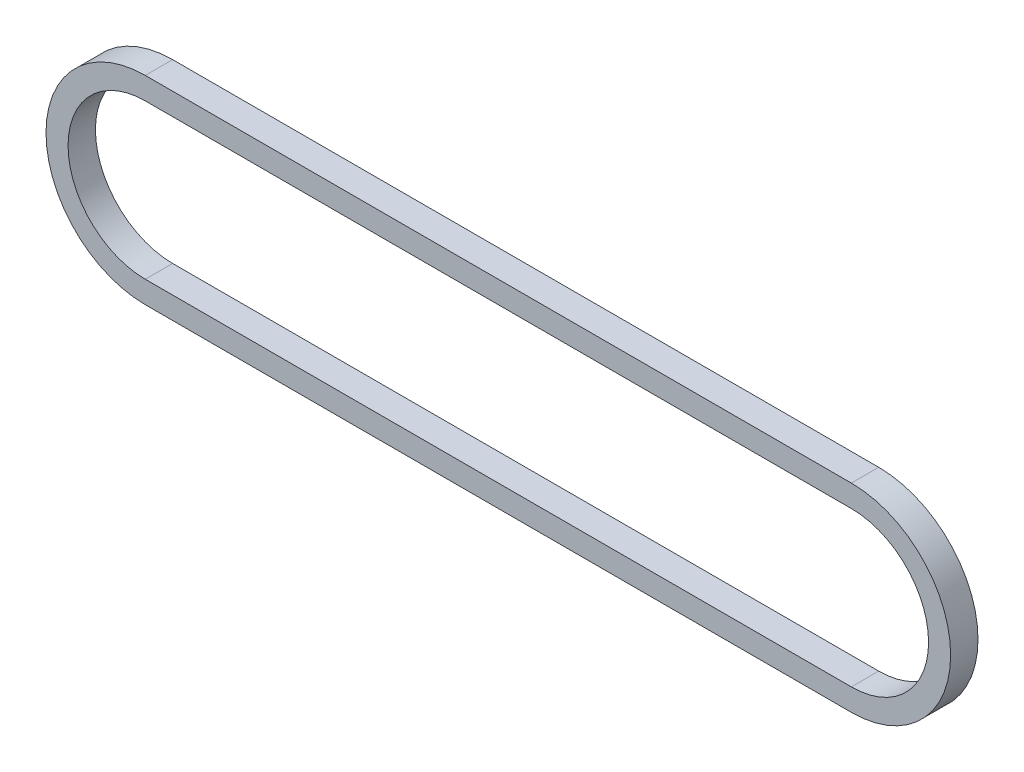
ISO-10303-21;
HEADER;
FILE_DESCRIPTION(('STEP AP214'),'2;1');
FILE_NAME('part.step','',(''),(''),'','','');
FILE_SCHEMA(('AUTOMOTIVE_DESIGN { 1 0 10303 214 1 1 1 1 }'));
ENDSEC;
DATA;
#1=APPLICATION_CONTEXT('core data for automotive mechanical design processes');
#2=APPLICATION_PROTOCOL_DEFINITION('international standard','automotive_design',2000,#1);
#3=PRODUCT_CONTEXT('',#1,'mechanical');
#4=PRODUCT('Part','Part','',(#3));
#5=PRODUCT_RELATED_PRODUCT_CATEGORY('part','',(#4));
#6=PRODUCT_DEFINITION_FORMATION('','',#4);
#7=PRODUCT_DEFINITION_CONTEXT('part definition',#1,'design');
#8=PRODUCT_DEFINITION('design','',#6,#7);
#9=PRODUCT_DEFINITION_SHAPE('','',#8);
#10=(LENGTH_UNIT() NAMED_UNIT(*) SI_UNIT(.MILLI.,.METRE.));
#11=(NAMED_UNIT(*) PLANE_ANGLE_UNIT() SI_UNIT($,.RADIAN.));
#12=(NAMED_UNIT(*) SI_UNIT($,.STERADIAN.) SOLID_ANGLE_UNIT());
#13=UNCERTAINTY_MEASURE_WITH_UNIT(LENGTH_MEASURE(1.E-05),#10,'distance_accuracy_value','');
#14=(GEOMETRIC_REPRESENTATION_CONTEXT(3) GLOBAL_UNCERTAINTY_ASSIGNED_CONTEXT((#13)) GLOBAL_UNIT_ASSIGNED_CONTEXT((#10,
#11,#12)) REPRESENTATION_CONTEXT('',''));
#15=CARTESIAN_POINT('',(0.,0.,0.));
#16=DIRECTION('',(0.,0.,1.));
#17=DIRECTION('',(1.,0.,0.));
#18=AXIS2_PLACEMENT_3D('',#15,#16,#17);
#19=CARTESIAN_POINT('',(0.,0.,7.874));
#20=DIRECTION('',(0.,0.,1.));
#21=DIRECTION('',(1.,0.,0.));
#22=AXIS2_PLACEMENT_3D('',#19,#20,#21);
#23=PLANE('',#22);
#24=CARTESIAN_POINT('',(0.,0.,7.874));
#25=DIRECTION('',(0.,0.,1.));
#26=DIRECTION('',(1.,0.,0.));
#27=AXIS2_PLACEMENT_3D('',#24,#25,#26);
#28=CIRCLE('',#27,28.575);
#29=CARTESIAN_POINT('',(0.,28.575,7.874));
#30=VERTEX_POINT('',#29);
#31=CARTESIAN_POINT('',(0.,-28.575,7.874));
#32=VERTEX_POINT('',#31);
#33=EDGE_CURVE('E159',#30,#32,#28,.T.);
#34=ORIENTED_EDGE('',*,*,#33,.T.);
#35=DIRECTION('',(1.,0.,0.));
#36=VECTOR('',#35,1.);
#37=CARTESIAN_POINT('',(0.,-28.575,7.874));
#38=LINE('',#37,#36);
#39=CARTESIAN_POINT('',(203.2,-28.575,7.874));
#40=VERTEX_POINT('',#39);
#41=EDGE_CURVE('E163',#32,#40,#38,.T.);
#42=ORIENTED_EDGE('',*,*,#41,.T.);
#43=CARTESIAN_POINT('',(203.2,0.,7.874));
#44=DIRECTION('',(0.,0.,1.));
#45=DIRECTION('',(1.,0.,0.));
#46=AXIS2_PLACEMENT_3D('',#43,#44,#45);
#47=CIRCLE('',#46,28.575);
#48=CARTESIAN_POINT('',(203.2,28.575,7.874));
#49=VERTEX_POINT('',#48);
#50=EDGE_CURVE('E167',#40,#49,#47,.T.);
#51=ORIENTED_EDGE('',*,*,#50,.T.);
#52=DIRECTION('',(-1.,0.,0.));
#53=VECTOR('',#52,1.);
#54=CARTESIAN_POINT('',(0.,28.575,7.874));
#55=LINE('',#54,#53);
#56=EDGE_CURVE('E170',#49,#30,#55,.T.);
#57=ORIENTED_EDGE('',*,*,#56,.T.);
#58=EDGE_LOOP('',(#34,#42,#51,#57));
#59=FACE_BOUND('',#58,.T.);
#60=DIRECTION('',(1.,0.,0.));
#61=VECTOR('',#60,1.);
#62=CARTESIAN_POINT('',(0.,-22.225,7.874));
#63=LINE('',#62,#61);
#64=CARTESIAN_POINT('',(0.,-22.225,7.874));
#65=VERTEX_POINT('',#64);
#66=CARTESIAN_POINT('',(203.2,-22.225,7.874));
#67=VERTEX_POINT('',#66);
#68=EDGE_CURVE('E120',#65,#67,#63,.T.);
#69=ORIENTED_EDGE('',*,*,#68,.F.);
#70=CARTESIAN_POINT('',(0.,0.,7.874));
#71=DIRECTION('',(0.,0.,1.));
#72=DIRECTION('',(1.,0.,0.));
#73=AXIS2_PLACEMENT_3D('',#70,#71,#72);
#74=CIRCLE('',#73,22.225);
#75=CARTESIAN_POINT('',(0.,22.225,7.874));
#76=VERTEX_POINT('',#75);
#77=EDGE_CURVE('E111',#76,#65,#74,.T.);
#78=ORIENTED_EDGE('',*,*,#77,.F.);
#79=DIRECTION('',(-1.,0.,0.));
#80=VECTOR('',#79,1.);
#81=CARTESIAN_POINT('',(0.,22.225,7.874));
#82=LINE('',#81,#80);
#83=CARTESIAN_POINT('',(203.2,22.225,7.874));
#84=VERTEX_POINT('',#83);
#85=EDGE_CURVE('E137',#84,#76,#82,.T.);
#86=ORIENTED_EDGE('',*,*,#85,.F.);
#87=CARTESIAN_POINT('',(203.2,0.,7.874));
#88=DIRECTION('',(0.,0.,1.));
#89=DIRECTION('',(1.,0.,0.));
#90=AXIS2_PLACEMENT_3D('',#87,#88,#89);
#91=CIRCLE('',#90,22.225);
#92=EDGE_CURVE('E133',#67,#84,#91,.T.);
#93=ORIENTED_EDGE('',*,*,#92,.F.);
#94=EDGE_LOOP('',(#69,#78,#86,#93));
#95=FACE_BOUND('',#94,.T.);
#96=ADVANCED_FACE('F45',(#59,#95),#23,.T.);
#97=CARTESIAN_POINT('',(0.,0.,0.));
#98=DIRECTION('',(0.,0.,1.));
#99=DIRECTION('',(1.,0.,0.));
#100=AXIS2_PLACEMENT_3D('',#97,#98,#99);
#101=PLANE('',#100);
#102=CARTESIAN_POINT('',(0.,0.,0.));
#103=DIRECTION('',(0.,0.,1.));
#104=DIRECTION('',(1.,0.,0.));
#105=AXIS2_PLACEMENT_3D('',#102,#103,#104);
#106=CIRCLE('',#105,28.575);
#107=CARTESIAN_POINT('',(0.,28.575,0.));
#108=VERTEX_POINT('',#107);
#109=CARTESIAN_POINT('',(0.,-28.575,0.));
#110=VERTEX_POINT('',#109);
#111=EDGE_CURVE('E129',#108,#110,#106,.T.);
#112=ORIENTED_EDGE('',*,*,#111,.F.);
#113=DIRECTION('',(-1.,0.,0.));
#114=VECTOR('',#113,1.);
#115=CARTESIAN_POINT('',(0.,28.575,0.));
#116=LINE('',#115,#114);
#117=CARTESIAN_POINT('',(203.2,28.575,0.));
#118=VERTEX_POINT('',#117);
#119=EDGE_CURVE('E164',#118,#108,#116,.T.);
#120=ORIENTED_EDGE('',*,*,#119,.F.);
#121=CARTESIAN_POINT('',(203.2,0.,0.));
#122=DIRECTION('',(0.,0.,1.));
#123=DIRECTION('',(1.,0.,0.));
#124=AXIS2_PLACEMENT_3D('',#121,#122,#123);
#125=CIRCLE('',#124,28.575);
#126=CARTESIAN_POINT('',(203.2,-28.575,0.));
#127=VERTEX_POINT('',#126);
#128=EDGE_CURVE('E180',#127,#118,#125,.T.);
#129=ORIENTED_EDGE('',*,*,#128,.F.);
#130=DIRECTION('',(1.,0.,0.));
#131=VECTOR('',#130,1.);
#132=CARTESIAN_POINT('',(0.,-28.575,0.));
#133=LINE('',#132,#131);
#134=EDGE_CURVE('E177',#110,#127,#133,.T.);
#135=ORIENTED_EDGE('',*,*,#134,.F.);
#136=EDGE_LOOP('',(#112,#120,#129,#135));
#137=FACE_BOUND('',#136,.T.);
#138=CARTESIAN_POINT('',(0.,0.,0.));
#139=DIRECTION('',(0.,0.,1.));
#140=DIRECTION('',(1.,0.,0.));
#141=AXIS2_PLACEMENT_3D('',#138,#139,#140);
#142=CIRCLE('',#141,22.225);
#143=CARTESIAN_POINT('',(0.,22.225,0.));
#144=VERTEX_POINT('',#143);
#145=CARTESIAN_POINT('',(0.,-22.225,0.));
#146=VERTEX_POINT('',#145);
#147=EDGE_CURVE('E69',#144,#146,#142,.T.);
#148=ORIENTED_EDGE('',*,*,#147,.T.);
#149=DIRECTION('',(1.,0.,0.));
#150=VECTOR('',#149,1.);
#151=CARTESIAN_POINT('',(0.,-22.225,0.));
#152=LINE('',#151,#150);
#153=CARTESIAN_POINT('',(203.2,-22.225,0.));
#154=VERTEX_POINT('',#153);
#155=EDGE_CURVE('E127',#146,#154,#152,.T.);
#156=ORIENTED_EDGE('',*,*,#155,.T.);
#157=CARTESIAN_POINT('',(203.2,0.,0.));
#158=DIRECTION('',(0.,0.,1.));
#159=DIRECTION('',(1.,0.,0.));
#160=AXIS2_PLACEMENT_3D('',#157,#158,#159);
#161=CIRCLE('',#160,22.225);
#162=CARTESIAN_POINT('',(203.2,22.225,0.));
#163=VERTEX_POINT('',#162);
#164=EDGE_CURVE('E146',#154,#163,#161,.T.);
#165=ORIENTED_EDGE('',*,*,#164,.T.);
#166=DIRECTION('',(-1.,0.,0.));
#167=VECTOR('',#166,1.);
#168=CARTESIAN_POINT('',(0.,22.225,0.));
#169=LINE('',#168,#167);
#170=EDGE_CURVE('E121',#163,#144,#169,.T.);
#171=ORIENTED_EDGE('',*,*,#170,.T.);
#172=EDGE_LOOP('',(#148,#156,#165,#171));
#173=FACE_BOUND('',#172,.T.);
#174=ADVANCED_FACE('F203',(#137,#173),#101,.F.);
#175=CARTESIAN_POINT('',(0.,0.,7.874));
#176=DIRECTION('',(0.,0.,-1.));
#177=DIRECTION('',(-1.,0.,0.));
#178=AXIS2_PLACEMENT_3D('',#175,#176,#177);
#179=CYLINDRICAL_SURFACE('',#178,28.575);
#180=ORIENTED_EDGE('',*,*,#111,.T.);
#181=DIRECTION('',(0.,0.,-1.));
#182=VECTOR('',#181,1.);
#183=CARTESIAN_POINT('',(0.,-28.575,7.874));
#184=LINE('',#183,#182);
#185=EDGE_CURVE('E11',#32,#110,#184,.T.);
#186=ORIENTED_EDGE('',*,*,#185,.F.);
#187=ORIENTED_EDGE('',*,*,#33,.F.);
#188=DIRECTION('',(0.,0.,-1.));
#189=VECTOR('',#188,1.);
#190=CARTESIAN_POINT('',(0.,28.575,7.874));
#191=LINE('',#190,#189);
#192=EDGE_CURVE('E173',#30,#108,#191,.T.);
#193=ORIENTED_EDGE('',*,*,#192,.T.);
#194=EDGE_LOOP('',(#180,#186,#187,#193));
#195=FACE_BOUND('',#194,.T.);
#196=ADVANCED_FACE('F47',(#195),#179,.T.);
#197=CARTESIAN_POINT('',(0.,-28.575,7.874));
#198=DIRECTION('',(0.,1.,0.));
#199=DIRECTION('',(0.,0.,1.));
#200=AXIS2_PLACEMENT_3D('',#197,#198,#199);
#201=PLANE('',#200);
#202=ORIENTED_EDGE('',*,*,#134,.T.);
#203=DIRECTION('',(0.,0.,-1.));
#204=VECTOR('',#203,1.);
#205=CARTESIAN_POINT('',(203.2,-28.575,7.874));
#206=LINE('',#205,#204);
#207=EDGE_CURVE('E54',#40,#127,#206,.T.);
#208=ORIENTED_EDGE('',*,*,#207,.F.);
#209=ORIENTED_EDGE('',*,*,#41,.F.);
#210=ORIENTED_EDGE('',*,*,#185,.T.);
#211=EDGE_LOOP('',(#202,#208,#209,#210));
#212=FACE_BOUND('',#211,.T.);
#213=ADVANCED_FACE('F213',(#212),#201,.F.);
#214=CARTESIAN_POINT('',(203.2,0.,7.874));
#215=DIRECTION('',(0.,0.,-1.));
#216=DIRECTION('',(-1.,0.,0.));
#217=AXIS2_PLACEMENT_3D('',#214,#215,#216);
#218=CYLINDRICAL_SURFACE('',#217,28.575);
#219=ORIENTED_EDGE('',*,*,#128,.T.);
#220=DIRECTION('',(0.,0.,-1.));
#221=VECTOR('',#220,1.);
#222=CARTESIAN_POINT('',(203.2,28.575,7.874));
#223=LINE('',#222,#221);
#224=EDGE_CURVE('E188',#49,#118,#223,.T.);
#225=ORIENTED_EDGE('',*,*,#224,.F.);
#226=ORIENTED_EDGE('',*,*,#50,.F.);
#227=ORIENTED_EDGE('',*,*,#207,.T.);
#228=EDGE_LOOP('',(#219,#225,#226,#227));
#229=FACE_BOUND('',#228,.T.);
#230=ADVANCED_FACE('F197',(#229),#218,.T.);
#231=CARTESIAN_POINT('',(0.,28.575,7.874));
#232=DIRECTION('',(0.,-1.,0.));
#233=DIRECTION('',(0.,0.,-1.));
#234=AXIS2_PLACEMENT_3D('',#231,#232,#233);
#235=PLANE('',#234);
#236=ORIENTED_EDGE('',*,*,#119,.T.);
#237=ORIENTED_EDGE('',*,*,#192,.F.);
#238=ORIENTED_EDGE('',*,*,#56,.F.);
#239=ORIENTED_EDGE('',*,*,#224,.T.);
#240=EDGE_LOOP('',(#236,#237,#238,#239));
#241=FACE_BOUND('',#240,.T.);
#242=ADVANCED_FACE('F207',(#241),#235,.F.);
#243=CARTESIAN_POINT('',(0.,0.,7.874));
#244=DIRECTION('',(0.,0.,-1.));
#245=DIRECTION('',(-1.,0.,0.));
#246=AXIS2_PLACEMENT_3D('',#243,#244,#245);
#247=CYLINDRICAL_SURFACE('',#246,22.225);
#248=ORIENTED_EDGE('',*,*,#147,.F.);
#249=DIRECTION('',(0.,0.,-1.));
#250=VECTOR('',#249,1.);
#251=CARTESIAN_POINT('',(0.,22.225,7.874));
#252=LINE('',#251,#250);
#253=EDGE_CURVE('E115',#76,#144,#252,.T.);
#254=ORIENTED_EDGE('',*,*,#253,.F.);
#255=ORIENTED_EDGE('',*,*,#77,.T.);
#256=DIRECTION('',(0.,0.,-1.));
#257=VECTOR('',#256,1.);
#258=CARTESIAN_POINT('',(0.,-22.225,7.874));
#259=LINE('',#258,#257);
#260=EDGE_CURVE('E114',#65,#146,#259,.T.);
#261=ORIENTED_EDGE('',*,*,#260,.T.);
#262=EDGE_LOOP('',(#248,#254,#255,#261));
#263=FACE_BOUND('',#262,.T.);
#264=ADVANCED_FACE('F113',(#263),#247,.F.);
#265=CARTESIAN_POINT('',(0.,-22.225,7.874));
#266=DIRECTION('',(0.,1.,0.));
#267=DIRECTION('',(0.,0.,1.));
#268=AXIS2_PLACEMENT_3D('',#265,#266,#267);
#269=PLANE('',#268);
#270=ORIENTED_EDGE('',*,*,#155,.F.);
#271=ORIENTED_EDGE('',*,*,#260,.F.);
#272=ORIENTED_EDGE('',*,*,#68,.T.);
#273=DIRECTION('',(0.,0.,-1.));
#274=VECTOR('',#273,1.);
#275=CARTESIAN_POINT('',(203.2,-22.225,7.874));
#276=LINE('',#275,#274);
#277=EDGE_CURVE('E130',#67,#154,#276,.T.);
#278=ORIENTED_EDGE('',*,*,#277,.T.);
#279=EDGE_LOOP('',(#270,#271,#272,#278));
#280=FACE_BOUND('',#279,.T.);
#281=ADVANCED_FACE('F124',(#280),#269,.T.);
#282=CARTESIAN_POINT('',(203.2,0.,7.874));
#283=DIRECTION('',(0.,0.,-1.));
#284=DIRECTION('',(-1.,0.,0.));
#285=AXIS2_PLACEMENT_3D('',#282,#283,#284);
#286=CYLINDRICAL_SURFACE('',#285,22.225);
#287=ORIENTED_EDGE('',*,*,#164,.F.);
#288=ORIENTED_EDGE('',*,*,#277,.F.);
#289=ORIENTED_EDGE('',*,*,#92,.T.);
#290=DIRECTION('',(0.,0.,-1.));
#291=VECTOR('',#290,1.);
#292=CARTESIAN_POINT('',(203.2,22.225,7.874));
#293=LINE('',#292,#291);
#294=EDGE_CURVE('E61',#84,#163,#293,.T.);
#295=ORIENTED_EDGE('',*,*,#294,.T.);
#296=EDGE_LOOP('',(#287,#288,#289,#295));
#297=FACE_BOUND('',#296,.T.);
#298=ADVANCED_FACE('F236',(#297),#286,.F.);
#299=CARTESIAN_POINT('',(0.,22.225,7.874));
#300=DIRECTION('',(0.,-1.,0.));
#301=DIRECTION('',(0.,0.,-1.));
#302=AXIS2_PLACEMENT_3D('',#299,#300,#301);
#303=PLANE('',#302);
#304=ORIENTED_EDGE('',*,*,#170,.F.);
#305=ORIENTED_EDGE('',*,*,#294,.F.);
#306=ORIENTED_EDGE('',*,*,#85,.T.);
#307=ORIENTED_EDGE('',*,*,#253,.T.);
#308=EDGE_LOOP('',(#304,#305,#306,#307));
#309=FACE_BOUND('',#308,.T.);
#310=ADVANCED_FACE('F240',(#309),#303,.T.);
#311=CLOSED_SHELL('',(#96,#174,#196,#213,#230,#242,#264,#281,#298,#310));
#312=MANIFOLD_SOLID_BREP('B2',#311);
#313=ADVANCED_BREP_SHAPE_REPRESENTATION('',(#18,#312),#14);
#314=SHAPE_DEFINITION_REPRESENTATION(#9,#313);
ENDSEC;
END-ISO-10303-21;
